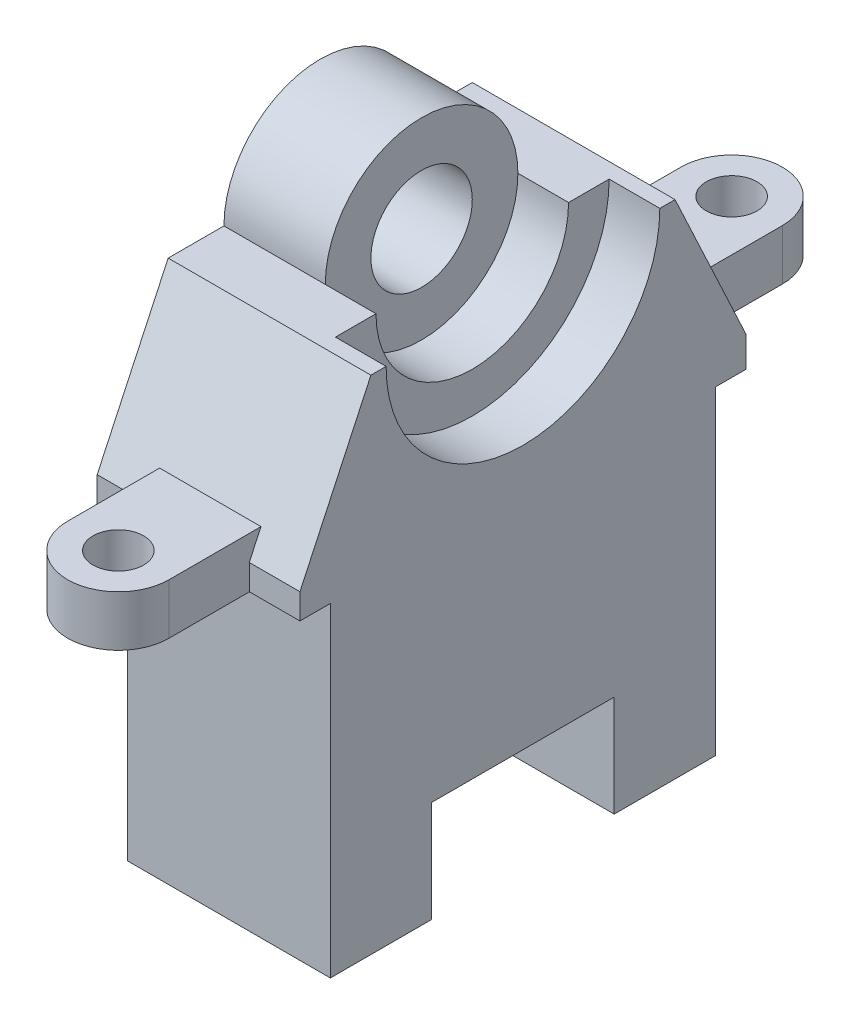
ISO-10303-21;
HEADER;
FILE_DESCRIPTION(('STEP AP214'),'2;1');
FILE_NAME('part.step','',(''),(''),'','','');
FILE_SCHEMA(('AUTOMOTIVE_DESIGN { 1 0 10303 214 1 1 1 1 }'));
ENDSEC;
DATA;
#1=APPLICATION_CONTEXT('core data for automotive mechanical design processes');
#2=APPLICATION_PROTOCOL_DEFINITION('international standard','automotive_design',2000,#1);
#3=PRODUCT_CONTEXT('',#1,'mechanical');
#4=PRODUCT('Part','Part','',(#3));
#5=PRODUCT_RELATED_PRODUCT_CATEGORY('part','',(#4));
#6=PRODUCT_DEFINITION_FORMATION('','',#4);
#7=PRODUCT_DEFINITION_CONTEXT('part definition',#1,'design');
#8=PRODUCT_DEFINITION('design','',#6,#7);
#9=PRODUCT_DEFINITION_SHAPE('','',#8);
#10=(LENGTH_UNIT() NAMED_UNIT(*) SI_UNIT(.MILLI.,.METRE.));
#11=(NAMED_UNIT(*) PLANE_ANGLE_UNIT() SI_UNIT($,.RADIAN.));
#12=(NAMED_UNIT(*) SI_UNIT($,.STERADIAN.) SOLID_ANGLE_UNIT());
#13=UNCERTAINTY_MEASURE_WITH_UNIT(LENGTH_MEASURE(1.E-05),#10,'distance_accuracy_value','');
#14=(GEOMETRIC_REPRESENTATION_CONTEXT(3) GLOBAL_UNCERTAINTY_ASSIGNED_CONTEXT((#13)) GLOBAL_UNIT_ASSIGNED_CONTEXT((#10,
#11,#12)) REPRESENTATION_CONTEXT('',''));
#15=CARTESIAN_POINT('',(0.,0.,0.));
#16=DIRECTION('',(0.,0.,1.));
#17=DIRECTION('',(1.,0.,0.));
#18=AXIS2_PLACEMENT_3D('',#15,#16,#17);
#19=CARTESIAN_POINT('',(40.,62.323723813514,30.7187028003413));
#20=DIRECTION('',(0.,-1.,0.));
#21=DIRECTION('',(0.,0.,-1.));
#22=AXIS2_PLACEMENT_3D('',#19,#20,#21);
#23=PLANE('',#22);
#24=DIRECTION('',(1.,0.,0.));
#25=VECTOR('',#24,1.);
#26=CARTESIAN_POINT('',(0.,62.323723813514,19.7187028003413));
#27=LINE('',#26,#25);
#28=CARTESIAN_POINT('',(0.,62.323723813514,19.7187028003413));
#29=VERTEX_POINT('',#28);
#30=CARTESIAN_POINT('',(20.,62.323723813514,19.7187028003413));
#31=VERTEX_POINT('',#30);
#32=EDGE_CURVE('E341',#29,#31,#27,.T.);
#33=ORIENTED_EDGE('',*,*,#32,.F.);
#34=DIRECTION('',(0.,0.,1.));
#35=VECTOR('',#34,1.);
#36=CARTESIAN_POINT('',(0.,62.323723813514,30.7187028003413));
#37=LINE('',#36,#35);
#38=CARTESIAN_POINT('',(0.,62.323723813514,30.7187028003413));
#39=VERTEX_POINT('',#38);
#40=EDGE_CURVE('E325',#29,#39,#37,.T.);
#41=ORIENTED_EDGE('',*,*,#40,.T.);
#42=DIRECTION('',(-1.,0.,0.));
#43=VECTOR('',#42,1.);
#44=CARTESIAN_POINT('',(40.,62.323723813514,30.7187028003413));
#45=LINE('',#44,#43);
#46=CARTESIAN_POINT('',(40.,62.323723813514,30.7187028003413));
#47=VERTEX_POINT('',#46);
#48=EDGE_CURVE('E587',#47,#39,#45,.T.);
#49=ORIENTED_EDGE('',*,*,#48,.F.);
#50=DIRECTION('',(0.,0.,1.));
#51=VECTOR('',#50,1.);
#52=CARTESIAN_POINT('',(40.,62.323723813514,30.7187028003413));
#53=LINE('',#52,#51);
#54=CARTESIAN_POINT('',(40.,62.323723813514,27.7187028003413));
#55=VERTEX_POINT('',#54);
#56=EDGE_CURVE('E650',#55,#47,#53,.T.);
#57=ORIENTED_EDGE('',*,*,#56,.F.);
#58=DIRECTION('',(-1.,0.,0.));
#59=VECTOR('',#58,1.);
#60=CARTESIAN_POINT('',(40.,62.323723813514,27.7187028003413));
#61=LINE('',#60,#59);
#62=CARTESIAN_POINT('',(30.,62.323723813514,27.7187028003413));
#63=VERTEX_POINT('',#62);
#64=EDGE_CURVE('E382',#63,#55,#61,.F.);
#65=ORIENTED_EDGE('',*,*,#64,.F.);
#66=DIRECTION('',(0.,0.,-1.));
#67=VECTOR('',#66,1.);
#68=CARTESIAN_POINT('',(30.,62.323723813514,27.7187028003413));
#69=LINE('',#68,#67);
#70=CARTESIAN_POINT('',(30.,62.323723813514,19.7187028003413));
#71=VERTEX_POINT('',#70);
#72=EDGE_CURVE('E360',#63,#71,#69,.T.);
#73=ORIENTED_EDGE('',*,*,#72,.T.);
#74=DIRECTION('',(1.,0.,0.));
#75=VECTOR('',#74,1.);
#76=CARTESIAN_POINT('',(20.,62.323723813514,19.7187028003413));
#77=LINE('',#76,#75);
#78=EDGE_CURVE('E343',#31,#71,#77,.T.);
#79=ORIENTED_EDGE('',*,*,#78,.F.);
#80=EDGE_LOOP('',(#33,#41,#49,#57,#65,#73,#79));
#81=FACE_BOUND('',#80,.T.);
#82=ADVANCED_FACE('F122',(#81),#23,.F.);
#83=CARTESIAN_POINT('',(0.,62.323723813514,-29.2812971996587));
#84=VERTEX_POINT('',#83);
#85=CARTESIAN_POINT('',(0.,62.323723813514,-18.2812971996587));
#86=VERTEX_POINT('',#85);
#87=EDGE_CURVE('E337',#84,#86,#37,.T.);
#88=ORIENTED_EDGE('',*,*,#87,.T.);
#89=DIRECTION('',(1.,0.,0.));
#90=VECTOR('',#89,1.);
#91=CARTESIAN_POINT('',(0.,62.323723813514,-18.2812971996587));
#92=LINE('',#91,#90);
#93=CARTESIAN_POINT('',(20.,62.323723813514,-18.2812971996587));
#94=VERTEX_POINT('',#93);
#95=EDGE_CURVE('E348',#86,#94,#92,.T.);
#96=ORIENTED_EDGE('',*,*,#95,.T.);
#97=DIRECTION('',(1.,0.,0.));
#98=VECTOR('',#97,1.);
#99=CARTESIAN_POINT('',(20.,62.323723813514,-18.2812971996587));
#100=LINE('',#99,#98);
#101=CARTESIAN_POINT('',(30.,62.323723813514,-18.2812971996587));
#102=VERTEX_POINT('',#101);
#103=EDGE_CURVE('E371',#94,#102,#100,.T.);
#104=ORIENTED_EDGE('',*,*,#103,.T.);
#105=DIRECTION('',(0.,0.,-1.));
#106=VECTOR('',#105,1.);
#107=CARTESIAN_POINT('',(30.,62.323723813514,-26.2812971996587));
#108=LINE('',#107,#106);
#109=CARTESIAN_POINT('',(30.,62.323723813514,-26.2812971996587));
#110=VERTEX_POINT('',#109);
#111=EDGE_CURVE('E365',#102,#110,#108,.T.);
#112=ORIENTED_EDGE('',*,*,#111,.T.);
#113=DIRECTION('',(-1.,0.,0.));
#114=VECTOR('',#113,1.);
#115=CARTESIAN_POINT('',(40.,62.323723813514,-26.2812971996587));
#116=LINE('',#115,#114);
#117=CARTESIAN_POINT('',(40.,62.323723813514,-26.2812971996587));
#118=VERTEX_POINT('',#117);
#119=EDGE_CURVE('E378',#118,#110,#116,.T.);
#120=ORIENTED_EDGE('',*,*,#119,.F.);
#121=CARTESIAN_POINT('',(40.,62.323723813514,-29.2812971996587));
#122=VERTEX_POINT('',#121);
#123=EDGE_CURVE('E656',#122,#118,#53,.T.);
#124=ORIENTED_EDGE('',*,*,#123,.F.);
#125=DIRECTION('',(-1.,0.,0.));
#126=VECTOR('',#125,1.);
#127=CARTESIAN_POINT('',(40.,62.323723813514,-29.2812971996587));
#128=LINE('',#127,#126);
#129=EDGE_CURVE('E589',#122,#84,#128,.T.);
#130=ORIENTED_EDGE('',*,*,#129,.T.);
#131=EDGE_LOOP('',(#88,#96,#104,#112,#120,#124,#130));
#132=FACE_BOUND('',#131,.T.);
#133=ADVANCED_FACE('F501',(#132),#23,.F.);
#134=CARTESIAN_POINT('',(40.,-36.676276186486,38.7187028003413));
#135=DIRECTION('',(0.,1.,0.));
#136=DIRECTION('',(0.,0.,1.));
#137=AXIS2_PLACEMENT_3D('',#134,#135,#136);
#138=PLANE('',#137);
#139=DIRECTION('',(0.,0.,-1.));
#140=VECTOR('',#139,1.);
#141=CARTESIAN_POINT('',(0.,-36.676276186486,38.7187028003413));
#142=LINE('',#141,#140);
#143=CARTESIAN_POINT('',(0.,-36.676276186486,38.7187028003413));
#144=VERTEX_POINT('',#143);
#145=CARTESIAN_POINT('',(0.,-36.676276186486,18.7187028003413));
#146=VERTEX_POINT('',#145);
#147=EDGE_CURVE('E547',#144,#146,#142,.T.);
#148=ORIENTED_EDGE('',*,*,#147,.T.);
#149=DIRECTION('',(1.,0.,0.));
#150=VECTOR('',#149,1.);
#151=CARTESIAN_POINT('',(-3.,-36.676276186486,18.7187028003413));
#152=LINE('',#151,#150);
#153=CARTESIAN_POINT('',(40.,-36.676276186486,18.7187028003413));
#154=VERTEX_POINT('',#153);
#155=EDGE_CURVE('E392',#146,#154,#152,.T.);
#156=ORIENTED_EDGE('',*,*,#155,.T.);
#157=DIRECTION('',(0.,0.,-1.));
#158=VECTOR('',#157,1.);
#159=CARTESIAN_POINT('',(40.,-36.676276186486,38.7187028003413));
#160=LINE('',#159,#158);
#161=CARTESIAN_POINT('',(40.,-36.676276186486,38.7187028003413));
#162=VERTEX_POINT('',#161);
#163=EDGE_CURVE('E682',#162,#154,#160,.T.);
#164=ORIENTED_EDGE('',*,*,#163,.F.);
#165=DIRECTION('',(-1.,0.,0.));
#166=VECTOR('',#165,1.);
#167=CARTESIAN_POINT('',(40.,-36.676276186486,38.7187028003413));
#168=LINE('',#167,#166);
#169=EDGE_CURVE('E550',#162,#144,#168,.T.);
#170=ORIENTED_EDGE('',*,*,#169,.T.);
#171=EDGE_LOOP('',(#148,#156,#164,#170));
#172=FACE_BOUND('',#171,.T.);
#173=ADVANCED_FACE('F506',(#172),#138,.F.);
#174=CARTESIAN_POINT('',(30.,37.2893818441082,39.546748703208));
#175=DIRECTION('',(0.,1.,0.));
#176=DIRECTION('',(0.,0.,1.));
#177=AXIS2_PLACEMENT_3D('',#174,#175,#176);
#178=PLANE('',#177);
#179=CARTESIAN_POINT('',(20.,37.2893818441082,60.546748703208));
#180=DIRECTION('',(0.,1.,0.));
#181=DIRECTION('',(0.,0.,1.));
#182=AXIS2_PLACEMENT_3D('',#179,#180,#181);
#183=CIRCLE('',#182,10.);
#184=CARTESIAN_POINT('',(30.,37.2893818441082,60.546748703208));
#185=VERTEX_POINT('',#184);
#186=CARTESIAN_POINT('',(10.,37.2893818441082,60.546748703208));
#187=VERTEX_POINT('',#186);
#188=EDGE_CURVE('E407',#185,#187,#183,.F.);
#189=ORIENTED_EDGE('',*,*,#188,.F.);
#190=DIRECTION('',(0.,0.,-1.));
#191=VECTOR('',#190,1.);
#192=CARTESIAN_POINT('',(30.,37.2893818441082,39.546748703208));
#193=LINE('',#192,#191);
#194=CARTESIAN_POINT('',(30.,37.2893818441082,42.4013957193974));
#195=VERTEX_POINT('',#194);
#196=EDGE_CURVE('E432',#185,#195,#193,.T.);
#197=ORIENTED_EDGE('',*,*,#196,.T.);
#198=DIRECTION('',(1.,0.,0.));
#199=VECTOR('',#198,1.);
#200=CARTESIAN_POINT('',(40.,37.2893818441082,42.4013957193974));
#201=LINE('',#200,#199);
#202=CARTESIAN_POINT('',(10.,37.2893818441082,42.4013957193974));
#203=VERTEX_POINT('',#202);
#204=EDGE_CURVE('E611',#203,#195,#201,.T.);
#205=ORIENTED_EDGE('',*,*,#204,.F.);
#206=DIRECTION('',(0.,0.,-1.));
#207=VECTOR('',#206,1.);
#208=CARTESIAN_POINT('',(10.,37.2893818441082,39.546748703208));
#209=LINE('',#208,#207);
#210=EDGE_CURVE('E440',#187,#203,#209,.T.);
#211=ORIENTED_EDGE('',*,*,#210,.F.);
#212=EDGE_LOOP('',(#189,#197,#205,#211));
#213=FACE_BOUND('',#212,.T.);
#214=CARTESIAN_POINT('',(20.,37.2893818441082,60.546748703208));
#215=DIRECTION('',(0.,1.,0.));
#216=DIRECTION('',(0.,0.,1.));
#217=AXIS2_PLACEMENT_3D('',#214,#215,#216);
#218=CIRCLE('',#217,5.);
#219=CARTESIAN_POINT('',(20.,37.2893818441082,65.546748703208));
#220=VERTEX_POINT('',#219);
#221=EDGE_CURVE('E403',#220,#220,#218,.F.);
#222=ORIENTED_EDGE('',*,*,#221,.T.);
#223=EDGE_LOOP('',(#222));
#224=FACE_BOUND('',#223,.T.);
#225=ADVANCED_FACE('F537',(#213,#224),#178,.T.);
#226=CARTESIAN_POINT('',(10.,27.2893818441082,39.546748703208));
#227=DIRECTION('',(0.,-1.,0.));
#228=DIRECTION('',(0.,0.,-1.));
#229=AXIS2_PLACEMENT_3D('',#226,#227,#228);
#230=PLANE('',#229);
#231=DIRECTION('',(0.,0.,-1.));
#232=VECTOR('',#231,1.);
#233=CARTESIAN_POINT('',(30.,27.2893818441082,39.546748703208));
#234=LINE('',#233,#232);
#235=CARTESIAN_POINT('',(30.,27.2893818441082,60.546748703208));
#236=VERTEX_POINT('',#235);
#237=CARTESIAN_POINT('',(30.,27.2893818441082,38.7187028003413));
#238=VERTEX_POINT('',#237);
#239=EDGE_CURVE('E445',#236,#238,#234,.T.);
#240=ORIENTED_EDGE('',*,*,#239,.F.);
#241=CARTESIAN_POINT('',(20.,27.2893818441082,60.546748703208));
#242=DIRECTION('',(0.,-1.,0.));
#243=DIRECTION('',(0.,0.,-1.));
#244=AXIS2_PLACEMENT_3D('',#241,#242,#243);
#245=CIRCLE('',#244,10.);
#246=CARTESIAN_POINT('',(10.,27.2893818441082,60.546748703208));
#247=VERTEX_POINT('',#246);
#248=EDGE_CURVE('E474',#247,#236,#245,.F.);
#249=ORIENTED_EDGE('',*,*,#248,.F.);
#250=DIRECTION('',(0.,0.,-1.));
#251=VECTOR('',#250,1.);
#252=CARTESIAN_POINT('',(10.,27.2893818441082,39.546748703208));
#253=LINE('',#252,#251);
#254=CARTESIAN_POINT('',(10.,27.2893818441082,38.7187028003413));
#255=VERTEX_POINT('',#254);
#256=EDGE_CURVE('E446',#247,#255,#253,.T.);
#257=ORIENTED_EDGE('',*,*,#256,.T.);
#258=DIRECTION('',(-1.,0.,0.));
#259=VECTOR('',#258,1.);
#260=CARTESIAN_POINT('',(40.,27.2893818441082,38.7187028003413));
#261=LINE('',#260,#259);
#262=EDGE_CURVE('E674',#238,#255,#261,.T.);
#263=ORIENTED_EDGE('',*,*,#262,.F.);
#264=EDGE_LOOP('',(#240,#249,#257,#263));
#265=FACE_BOUND('',#264,.T.);
#266=CARTESIAN_POINT('',(20.,27.2893818441082,60.546748703208));
#267=DIRECTION('',(0.,-1.,0.));
#268=DIRECTION('',(0.,0.,-1.));
#269=AXIS2_PLACEMENT_3D('',#266,#267,#268);
#270=CIRCLE('',#269,5.);
#271=CARTESIAN_POINT('',(20.,27.2893818441082,55.546748703208));
#272=VERTEX_POINT('',#271);
#273=EDGE_CURVE('E402',#272,#272,#270,.F.);
#274=ORIENTED_EDGE('',*,*,#273,.T.);
#275=EDGE_LOOP('',(#274));
#276=FACE_BOUND('',#275,.T.);
#277=ADVANCED_FACE('F481',(#265,#276),#230,.T.);
#278=CARTESIAN_POINT('',(10.,37.2893818441082,39.546748703208));
#279=DIRECTION('',(-1.,0.,0.));
#280=DIRECTION('',(0.,0.,1.));
#281=AXIS2_PLACEMENT_3D('',#278,#279,#280);
#282=PLANE('',#281);
#283=ORIENTED_EDGE('',*,*,#256,.F.);
#284=DIRECTION('',(0.,-1.,0.));
#285=VECTOR('',#284,1.);
#286=CARTESIAN_POINT('',(10.,84.,60.546748703208));
#287=LINE('',#286,#285);
#288=EDGE_CURVE('E145',#187,#247,#287,.T.);
#289=ORIENTED_EDGE('',*,*,#288,.F.);
#290=ORIENTED_EDGE('',*,*,#210,.T.);
#291=DIRECTION('',(0.,0.906183139995266,-0.422885465331124));
#292=VECTOR('',#291,1.);
#293=CARTESIAN_POINT('',(10.,32.323723813514,44.7187028003413));
#294=LINE('',#293,#292);
#295=CARTESIAN_POINT('',(10.,32.323723813514,44.7187028003413));
#296=VERTEX_POINT('',#295);
#297=EDGE_CURVE('E696',#296,#203,#294,.T.);
#298=ORIENTED_EDGE('',*,*,#297,.F.);
#299=DIRECTION('',(0.,1.,0.));
#300=VECTOR('',#299,1.);
#301=CARTESIAN_POINT('',(10.,27.323723813514,44.7187028003413));
#302=LINE('',#301,#300);
#303=CARTESIAN_POINT('',(10.,27.323723813514,44.7187028003413));
#304=VERTEX_POINT('',#303);
#305=EDGE_CURVE('E462',#304,#296,#302,.T.);
#306=ORIENTED_EDGE('',*,*,#305,.F.);
#307=DIRECTION('',(0.,0.,1.));
#308=VECTOR('',#307,1.);
#309=CARTESIAN_POINT('',(10.,27.323723813514,38.7187028003413));
#310=LINE('',#309,#308);
#311=CARTESIAN_POINT('',(10.,27.323723813514,38.7187028003413));
#312=VERTEX_POINT('',#311);
#313=EDGE_CURVE('E609',#312,#304,#310,.T.);
#314=ORIENTED_EDGE('',*,*,#313,.F.);
#315=DIRECTION('',(0.,1.,0.));
#316=VECTOR('',#315,1.);
#317=CARTESIAN_POINT('',(10.,-36.676276186486,38.7187028003413));
#318=LINE('',#317,#316);
#319=EDGE_CURVE('E670',#255,#312,#318,.T.);
#320=ORIENTED_EDGE('',*,*,#319,.F.);
#321=EDGE_LOOP('',(#283,#289,#290,#298,#306,#314,#320));
#322=FACE_BOUND('',#321,.T.);
#323=ADVANCED_FACE('F768',(#322),#282,.T.);
#324=CARTESIAN_POINT('',(20.,27.2893818441082,-60.453251296792));
#325=DIRECTION('',(0.,-1.,0.));
#326=DIRECTION('',(0.,0.,-1.));
#327=AXIS2_PLACEMENT_3D('',#324,#325,#326);
#328=CIRCLE('',#327,5.);
#329=CARTESIAN_POINT('',(20.,27.2893818441082,-65.453251296792));
#330=VERTEX_POINT('',#329);
#331=EDGE_CURVE('E415',#330,#330,#328,.T.);
#332=ORIENTED_EDGE('',*,*,#331,.F.);
#333=EDGE_LOOP('',(#332));
#334=FACE_BOUND('',#333,.T.);
#335=CARTESIAN_POINT('',(20.,27.2893818441082,-60.453251296792));
#336=DIRECTION('',(0.,-1.,0.));
#337=DIRECTION('',(0.,0.,-1.));
#338=AXIS2_PLACEMENT_3D('',#335,#336,#337);
#339=CIRCLE('',#338,10.);
#340=CARTESIAN_POINT('',(10.,27.2893818441082,-60.453251296792));
#341=VERTEX_POINT('',#340);
#342=CARTESIAN_POINT('',(30.,27.2893818441082,-60.453251296792));
#343=VERTEX_POINT('',#342);
#344=EDGE_CURVE('E423',#341,#343,#339,.T.);
#345=ORIENTED_EDGE('',*,*,#344,.T.);
#346=CARTESIAN_POINT('',(30.,27.2893818441082,-43.2812971996586));
#347=VERTEX_POINT('',#346);
#348=EDGE_CURVE('E442',#347,#343,#234,.T.);
#349=ORIENTED_EDGE('',*,*,#348,.F.);
#350=DIRECTION('',(1.,0.,0.));
#351=VECTOR('',#350,1.);
#352=CARTESIAN_POINT('',(40.,27.2893818441082,-43.2812971996586));
#353=LINE('',#352,#351);
#354=CARTESIAN_POINT('',(10.,27.2893818441082,-43.2812971996586));
#355=VERTEX_POINT('',#354);
#356=EDGE_CURVE('E472',#355,#347,#353,.T.);
#357=ORIENTED_EDGE('',*,*,#356,.F.);
#358=EDGE_CURVE('E463',#355,#341,#253,.T.);
#359=ORIENTED_EDGE('',*,*,#358,.T.);
#360=EDGE_LOOP('',(#345,#349,#357,#359));
#361=FACE_BOUND('',#360,.T.);
#362=ADVANCED_FACE('F624',(#334,#361),#230,.T.);
#363=CARTESIAN_POINT('',(20.,37.2893818441082,-60.453251296792));
#364=DIRECTION('',(0.,1.,0.));
#365=DIRECTION('',(0.,0.,1.));
#366=AXIS2_PLACEMENT_3D('',#363,#364,#365);
#367=CIRCLE('',#366,5.);
#368=CARTESIAN_POINT('',(20.,37.2893818441082,-55.453251296792));
#369=VERTEX_POINT('',#368);
#370=EDGE_CURVE('E409',#369,#369,#367,.T.);
#371=ORIENTED_EDGE('',*,*,#370,.F.);
#372=EDGE_LOOP('',(#371));
#373=FACE_BOUND('',#372,.T.);
#374=CARTESIAN_POINT('',(30.,37.2893818441082,-40.9639901187147));
#375=VERTEX_POINT('',#374);
#376=CARTESIAN_POINT('',(30.,37.2893818441082,-60.453251296792));
#377=VERTEX_POINT('',#376);
#378=EDGE_CURVE('E436',#375,#377,#193,.T.);
#379=ORIENTED_EDGE('',*,*,#378,.T.);
#380=CARTESIAN_POINT('',(20.,37.2893818441082,-60.453251296792));
#381=DIRECTION('',(0.,1.,0.));
#382=DIRECTION('',(0.,0.,1.));
#383=AXIS2_PLACEMENT_3D('',#380,#381,#382);
#384=CIRCLE('',#383,10.);
#385=CARTESIAN_POINT('',(10.,37.2893818441082,-60.453251296792));
#386=VERTEX_POINT('',#385);
#387=EDGE_CURVE('E418',#377,#386,#384,.T.);
#388=ORIENTED_EDGE('',*,*,#387,.T.);
#389=CARTESIAN_POINT('',(10.,37.2893818441082,-40.9639901187147));
#390=VERTEX_POINT('',#389);
#391=EDGE_CURVE('E425',#390,#386,#209,.T.);
#392=ORIENTED_EDGE('',*,*,#391,.F.);
#393=DIRECTION('',(-1.,0.,0.));
#394=VECTOR('',#393,1.);
#395=CARTESIAN_POINT('',(40.,37.2893818441082,-40.9639901187147));
#396=LINE('',#395,#394);
#397=EDGE_CURVE('E637',#375,#390,#396,.T.);
#398=ORIENTED_EDGE('',*,*,#397,.F.);
#399=EDGE_LOOP('',(#379,#388,#392,#398));
#400=FACE_BOUND('',#399,.T.);
#401=ADVANCED_FACE('F544',(#373,#400),#178,.T.);
#402=CARTESIAN_POINT('',(30.,37.2893818441082,39.546748703208));
#403=DIRECTION('',(1.,0.,0.));
#404=DIRECTION('',(0.,0.,-1.));
#405=AXIS2_PLACEMENT_3D('',#402,#403,#404);
#406=PLANE('',#405);
#407=ORIENTED_EDGE('',*,*,#348,.T.);
#408=DIRECTION('',(0.,1.,0.));
#409=VECTOR('',#408,1.);
#410=CARTESIAN_POINT('',(30.,7.28938184410818,-60.453251296792));
#411=LINE('',#410,#409);
#412=EDGE_CURVE('E412',#343,#377,#411,.T.);
#413=ORIENTED_EDGE('',*,*,#412,.T.);
#414=ORIENTED_EDGE('',*,*,#378,.F.);
#415=DIRECTION('',(0.,0.906183139995266,0.422885465331124));
#416=VECTOR('',#415,1.);
#417=CARTESIAN_POINT('',(30.,62.323723813514,-29.2812971996587));
#418=LINE('',#417,#416);
#419=CARTESIAN_POINT('',(30.,32.323723813514,-43.2812971996587));
#420=VERTEX_POINT('',#419);
#421=EDGE_CURVE('E456',#420,#375,#418,.T.);
#422=ORIENTED_EDGE('',*,*,#421,.F.);
#423=DIRECTION('',(0.,1.,0.));
#424=VECTOR('',#423,1.);
#425=CARTESIAN_POINT('',(30.,26.323723813514,-43.2812971996586));
#426=LINE('',#425,#424);
#427=EDGE_CURVE('E459',#347,#420,#426,.T.);
#428=ORIENTED_EDGE('',*,*,#427,.F.);
#429=EDGE_LOOP('',(#407,#413,#414,#422,#428));
#430=FACE_BOUND('',#429,.T.);
#431=ADVANCED_FACE('F639',(#430),#406,.T.);
#432=CARTESIAN_POINT('',(40.,27.323723813514,44.7187028003413));
#433=DIRECTION('',(0.,0.,-1.));
#434=DIRECTION('',(-1.,0.,0.));
#435=AXIS2_PLACEMENT_3D('',#432,#433,#434);
#436=PLANE('',#435);
#437=DIRECTION('',(-1.,0.,0.));
#438=VECTOR('',#437,1.);
#439=CARTESIAN_POINT('',(40.,27.323723813514,44.7187028003413));
#440=LINE('',#439,#438);
#441=CARTESIAN_POINT('',(0.,27.323723813514,44.7187028003413));
#442=VERTEX_POINT('',#441);
#443=EDGE_CURVE('E578',#304,#442,#440,.T.);
#444=ORIENTED_EDGE('',*,*,#443,.F.);
#445=ORIENTED_EDGE('',*,*,#305,.T.);
#446=DIRECTION('',(-1.,0.,0.));
#447=VECTOR('',#446,1.);
#448=CARTESIAN_POINT('',(40.,32.323723813514,44.7187028003413));
#449=LINE('',#448,#447);
#450=CARTESIAN_POINT('',(0.,32.323723813514,44.7187028003413));
#451=VERTEX_POINT('',#450);
#452=EDGE_CURVE('E583',#296,#451,#449,.T.);
#453=ORIENTED_EDGE('',*,*,#452,.T.);
#454=DIRECTION('',(0.,-1.,0.));
#455=VECTOR('',#454,1.);
#456=CARTESIAN_POINT('',(0.,27.323723813514,44.7187028003413));
#457=LINE('',#456,#455);
#458=EDGE_CURVE('E568',#451,#442,#457,.T.);
#459=ORIENTED_EDGE('',*,*,#458,.T.);
#460=EDGE_LOOP('',(#444,#445,#453,#459));
#461=FACE_BOUND('',#460,.T.);
#462=ADVANCED_FACE('F702',(#461),#436,.F.);
#463=CARTESIAN_POINT('',(40.,27.323723813514,38.7187028003413));
#464=DIRECTION('',(0.,1.,0.));
#465=DIRECTION('',(0.,0.,1.));
#466=AXIS2_PLACEMENT_3D('',#463,#464,#465);
#467=PLANE('',#466);
#468=DIRECTION('',(-1.,0.,0.));
#469=VECTOR('',#468,1.);
#470=CARTESIAN_POINT('',(40.,27.323723813514,38.7187028003413));
#471=LINE('',#470,#469);
#472=CARTESIAN_POINT('',(0.,27.323723813514,38.7187028003413));
#473=VERTEX_POINT('',#472);
#474=EDGE_CURVE('E579',#312,#473,#471,.T.);
#475=ORIENTED_EDGE('',*,*,#474,.F.);
#476=ORIENTED_EDGE('',*,*,#313,.T.);
#477=ORIENTED_EDGE('',*,*,#443,.T.);
#478=DIRECTION('',(0.,0.,-1.));
#479=VECTOR('',#478,1.);
#480=CARTESIAN_POINT('',(0.,27.323723813514,38.7187028003413));
#481=LINE('',#480,#479);
#482=EDGE_CURVE('E571',#442,#473,#481,.T.);
#483=ORIENTED_EDGE('',*,*,#482,.T.);
#484=EDGE_LOOP('',(#475,#476,#477,#483));
#485=FACE_BOUND('',#484,.T.);
#486=ADVANCED_FACE('F533',(#485),#467,.F.);
#487=CARTESIAN_POINT('',(40.,-36.676276186486,38.7187028003413));
#488=DIRECTION('',(0.,0.,-1.));
#489=DIRECTION('',(-1.,0.,0.));
#490=AXIS2_PLACEMENT_3D('',#487,#488,#489);
#491=PLANE('',#490);
#492=ORIENTED_EDGE('',*,*,#262,.T.);
#493=ORIENTED_EDGE('',*,*,#319,.T.);
#494=ORIENTED_EDGE('',*,*,#474,.T.);
#495=DIRECTION('',(0.,-1.,0.));
#496=VECTOR('',#495,1.);
#497=CARTESIAN_POINT('',(0.,-36.676276186486,38.7187028003413));
#498=LINE('',#497,#496);
#499=EDGE_CURVE('E558',#473,#144,#498,.T.);
#500=ORIENTED_EDGE('',*,*,#499,.T.);
#501=ORIENTED_EDGE('',*,*,#169,.F.);
#502=DIRECTION('',(0.,-1.,0.));
#503=VECTOR('',#502,1.);
#504=CARTESIAN_POINT('',(40.,-36.676276186486,38.7187028003413));
#505=LINE('',#504,#503);
#506=CARTESIAN_POINT('',(40.,27.323723813514,38.7187028003413));
#507=VERTEX_POINT('',#506);
#508=EDGE_CURVE('E574',#507,#162,#505,.T.);
#509=ORIENTED_EDGE('',*,*,#508,.F.);
#510=CARTESIAN_POINT('',(30.,27.323723813514,38.7187028003413));
#511=VERTEX_POINT('',#510);
#512=EDGE_CURVE('E575',#507,#511,#471,.T.);
#513=ORIENTED_EDGE('',*,*,#512,.T.);
#514=DIRECTION('',(0.,-1.,0.));
#515=VECTOR('',#514,1.);
#516=CARTESIAN_POINT('',(30.,-36.676276186486,38.7187028003413));
#517=LINE('',#516,#515);
#518=EDGE_CURVE('E453',#511,#238,#517,.T.);
#519=ORIENTED_EDGE('',*,*,#518,.T.);
#520=EDGE_LOOP('',(#492,#493,#494,#500,#501,#509,#513,#519));
#521=FACE_BOUND('',#520,.T.);
#522=ADVANCED_FACE('F124',(#521),#491,.F.);
#523=CARTESIAN_POINT('',(40.,-36.676276186486,-17.2812971996587));
#524=VERTEX_POINT('',#523);
#525=CARTESIAN_POINT('',(40.,-36.676276186486,-37.2812971996587));
#526=VERTEX_POINT('',#525);
#527=EDGE_CURVE('E681',#524,#526,#160,.T.);
#528=ORIENTED_EDGE('',*,*,#527,.F.);
#529=DIRECTION('',(1.,0.,0.));
#530=VECTOR('',#529,1.);
#531=CARTESIAN_POINT('',(-3.,-36.676276186486,-17.2812971996587));
#532=LINE('',#531,#530);
#533=CARTESIAN_POINT('',(0.,-36.676276186486,-17.2812971996587));
#534=VERTEX_POINT('',#533);
#535=EDGE_CURVE('E391',#534,#524,#532,.T.);
#536=ORIENTED_EDGE('',*,*,#535,.F.);
#537=CARTESIAN_POINT('',(0.,-36.676276186486,-37.2812971996587));
#538=VERTEX_POINT('',#537);
#539=EDGE_CURVE('E554',#534,#538,#142,.T.);
#540=ORIENTED_EDGE('',*,*,#539,.T.);
#541=DIRECTION('',(-1.,0.,0.));
#542=VECTOR('',#541,1.);
#543=CARTESIAN_POINT('',(40.,-36.676276186486,-37.2812971996587));
#544=LINE('',#543,#542);
#545=EDGE_CURVE('E602',#526,#538,#544,.T.);
#546=ORIENTED_EDGE('',*,*,#545,.F.);
#547=EDGE_LOOP('',(#528,#536,#540,#546));
#548=FACE_BOUND('',#547,.T.);
#549=ADVANCED_FACE('F526',(#548),#138,.F.);
#550=CARTESIAN_POINT('',(40.,-36.676276186486,-37.2812971996587));
#551=DIRECTION('',(0.,0.,1.));
#552=DIRECTION('',(1.,0.,0.));
#553=AXIS2_PLACEMENT_3D('',#550,#551,#552);
#554=PLANE('',#553);
#555=DIRECTION('',(0.,1.,0.));
#556=VECTOR('',#555,1.);
#557=CARTESIAN_POINT('',(0.,-36.676276186486,-37.2812971996587));
#558=LINE('',#557,#556);
#559=CARTESIAN_POINT('',(0.,26.323723813514,-37.2812971996587));
#560=VERTEX_POINT('',#559);
#561=EDGE_CURVE('E553',#538,#560,#558,.T.);
#562=ORIENTED_EDGE('',*,*,#561,.T.);
#563=DIRECTION('',(-1.,0.,0.));
#564=VECTOR('',#563,1.);
#565=CARTESIAN_POINT('',(40.,26.323723813514,-37.2812971996587));
#566=LINE('',#565,#564);
#567=CARTESIAN_POINT('',(40.,26.323723813514,-37.2812971996587));
#568=VERTEX_POINT('',#567);
#569=EDGE_CURVE('E599',#568,#560,#566,.T.);
#570=ORIENTED_EDGE('',*,*,#569,.F.);
#571=DIRECTION('',(0.,1.,0.));
#572=VECTOR('',#571,1.);
#573=CARTESIAN_POINT('',(40.,-36.676276186486,-37.2812971996587));
#574=LINE('',#573,#572);
#575=EDGE_CURVE('E652',#526,#568,#574,.T.);
#576=ORIENTED_EDGE('',*,*,#575,.F.);
#577=ORIENTED_EDGE('',*,*,#545,.T.);
#578=EDGE_LOOP('',(#562,#570,#576,#577));
#579=FACE_BOUND('',#578,.T.);
#580=ADVANCED_FACE('F523',(#579),#554,.F.);
#581=CARTESIAN_POINT('',(40.,26.323723813514,-37.2812971996587));
#582=DIRECTION('',(0.,1.,0.));
#583=DIRECTION('',(0.,0.,1.));
#584=AXIS2_PLACEMENT_3D('',#581,#582,#583);
#585=PLANE('',#584);
#586=DIRECTION('',(0.,0.,-1.));
#587=VECTOR('',#586,1.);
#588=CARTESIAN_POINT('',(0.,26.323723813514,-37.2812971996587));
#589=LINE('',#588,#587);
#590=CARTESIAN_POINT('',(0.,26.323723813514,-43.2812971996586));
#591=VERTEX_POINT('',#590);
#592=EDGE_CURVE('E556',#560,#591,#589,.T.);
#593=ORIENTED_EDGE('',*,*,#592,.T.);
#594=DIRECTION('',(-1.,0.,0.));
#595=VECTOR('',#594,1.);
#596=CARTESIAN_POINT('',(40.,26.323723813514,-43.2812971996586));
#597=LINE('',#596,#595);
#598=CARTESIAN_POINT('',(40.,26.323723813514,-43.2812971996586));
#599=VERTEX_POINT('',#598);
#600=EDGE_CURVE('E596',#599,#591,#597,.T.);
#601=ORIENTED_EDGE('',*,*,#600,.F.);
#602=DIRECTION('',(0.,0.,-1.));
#603=VECTOR('',#602,1.);
#604=CARTESIAN_POINT('',(40.,26.323723813514,-37.2812971996587));
#605=LINE('',#604,#603);
#606=EDGE_CURVE('E648',#568,#599,#605,.T.);
#607=ORIENTED_EDGE('',*,*,#606,.F.);
#608=ORIENTED_EDGE('',*,*,#569,.T.);
#609=EDGE_LOOP('',(#593,#601,#607,#608));
#610=FACE_BOUND('',#609,.T.);
#611=ADVANCED_FACE('F519',(#610),#585,.F.);
#612=CARTESIAN_POINT('',(40.,26.323723813514,-43.2812971996586));
#613=DIRECTION('',(0.,0.,1.));
#614=DIRECTION('',(0.,-1.,0.));
#615=AXIS2_PLACEMENT_3D('',#612,#613,#614);
#616=PLANE('',#615);
#617=DIRECTION('',(-1.,0.,0.));
#618=VECTOR('',#617,1.);
#619=CARTESIAN_POINT('',(40.,32.323723813514,-43.2812971996587));
#620=LINE('',#619,#618);
#621=CARTESIAN_POINT('',(10.,32.323723813514,-43.2812971996587));
#622=VERTEX_POINT('',#621);
#623=CARTESIAN_POINT('',(0.,32.323723813514,-43.2812971996587));
#624=VERTEX_POINT('',#623);
#625=EDGE_CURVE('E592',#622,#624,#620,.T.);
#626=ORIENTED_EDGE('',*,*,#625,.F.);
#627=DIRECTION('',(0.,-1.,0.));
#628=VECTOR('',#627,1.);
#629=CARTESIAN_POINT('',(10.,26.323723813514,-43.2812971996586));
#630=LINE('',#629,#628);
#631=EDGE_CURVE('E620',#622,#355,#630,.T.);
#632=ORIENTED_EDGE('',*,*,#631,.T.);
#633=ORIENTED_EDGE('',*,*,#356,.T.);
#634=ORIENTED_EDGE('',*,*,#427,.T.);
#635=CARTESIAN_POINT('',(40.,32.323723813514,-43.2812971996587));
#636=VERTEX_POINT('',#635);
#637=EDGE_CURVE('E593',#636,#420,#620,.T.);
#638=ORIENTED_EDGE('',*,*,#637,.F.);
#639=DIRECTION('',(0.,1.,0.));
#640=VECTOR('',#639,1.);
#641=CARTESIAN_POINT('',(40.,26.323723813514,-43.2812971996586));
#642=LINE('',#641,#640);
#643=EDGE_CURVE('E644',#599,#636,#642,.T.);
#644=ORIENTED_EDGE('',*,*,#643,.F.);
#645=ORIENTED_EDGE('',*,*,#600,.T.);
#646=DIRECTION('',(0.,1.,0.));
#647=VECTOR('',#646,1.);
#648=CARTESIAN_POINT('',(0.,26.323723813514,-43.2812971996586));
#649=LINE('',#648,#647);
#650=EDGE_CURVE('E563',#591,#624,#649,.T.);
#651=ORIENTED_EDGE('',*,*,#650,.T.);
#652=EDGE_LOOP('',(#626,#632,#633,#634,#638,#644,#645,#651));
#653=FACE_BOUND('',#652,.T.);
#654=ADVANCED_FACE('F515',(#653),#616,.F.);
#655=CARTESIAN_POINT('',(40.,62.323723813514,-29.2812971996587));
#656=DIRECTION('',(0.,-0.422885465331124,0.906183139995265));
#657=DIRECTION('',(0.,-0.906183139995266,-0.422885465331124));
#658=AXIS2_PLACEMENT_3D('',#655,#656,#657);
#659=PLANE('',#658);
#660=ORIENTED_EDGE('',*,*,#397,.T.);
#661=DIRECTION('',(0.,-0.906183139995266,-0.422885465331124));
#662=VECTOR('',#661,1.);
#663=CARTESIAN_POINT('',(10.,62.323723813514,-29.2812971996587));
#664=LINE('',#663,#662);
#665=EDGE_CURVE('E694',#390,#622,#664,.T.);
#666=ORIENTED_EDGE('',*,*,#665,.T.);
#667=ORIENTED_EDGE('',*,*,#625,.T.);
#668=DIRECTION('',(0.,0.906183139995265,0.422885465331124));
#669=VECTOR('',#668,1.);
#670=CARTESIAN_POINT('',(0.,62.323723813514,-29.2812971996587));
#671=LINE('',#670,#669);
#672=EDGE_CURVE('E338',#624,#84,#671,.T.);
#673=ORIENTED_EDGE('',*,*,#672,.T.);
#674=ORIENTED_EDGE('',*,*,#129,.F.);
#675=DIRECTION('',(0.,0.906183139995265,0.422885465331124));
#676=VECTOR('',#675,1.);
#677=CARTESIAN_POINT('',(40.,62.323723813514,-29.2812971996587));
#678=LINE('',#677,#676);
#679=EDGE_CURVE('E642',#636,#122,#678,.T.);
#680=ORIENTED_EDGE('',*,*,#679,.F.);
#681=ORIENTED_EDGE('',*,*,#637,.T.);
#682=ORIENTED_EDGE('',*,*,#421,.T.);
#683=EDGE_LOOP('',(#660,#666,#667,#673,#674,#680,#681,#682));
#684=FACE_BOUND('',#683,.T.);
#685=ADVANCED_FACE('F512',(#684),#659,.F.);
#686=CARTESIAN_POINT('',(40.,32.323723813514,44.7187028003413));
#687=DIRECTION('',(0.,-0.422885465331124,-0.906183139995265));
#688=DIRECTION('',(0.,0.906183139995266,-0.422885465331124));
#689=AXIS2_PLACEMENT_3D('',#686,#687,#688);
#690=PLANE('',#689);
#691=ORIENTED_EDGE('',*,*,#452,.F.);
#692=ORIENTED_EDGE('',*,*,#297,.T.);
#693=ORIENTED_EDGE('',*,*,#204,.T.);
#694=DIRECTION('',(0.,-0.906183139995266,0.422885465331124));
#695=VECTOR('',#694,1.);
#696=CARTESIAN_POINT('',(30.,32.323723813514,44.7187028003413));
#697=LINE('',#696,#695);
#698=CARTESIAN_POINT('',(30.,32.323723813514,44.7187028003413));
#699=VERTEX_POINT('',#698);
#700=EDGE_CURVE('E450',#195,#699,#697,.T.);
#701=ORIENTED_EDGE('',*,*,#700,.T.);
#702=CARTESIAN_POINT('',(40.,32.323723813514,44.7187028003413));
#703=VERTEX_POINT('',#702);
#704=EDGE_CURVE('E584',#703,#699,#449,.T.);
#705=ORIENTED_EDGE('',*,*,#704,.F.);
#706=DIRECTION('',(0.,-0.906183139995265,0.422885465331124));
#707=VECTOR('',#706,1.);
#708=CARTESIAN_POINT('',(40.,32.323723813514,44.7187028003413));
#709=LINE('',#708,#707);
#710=EDGE_CURVE('E659',#47,#703,#709,.T.);
#711=ORIENTED_EDGE('',*,*,#710,.F.);
#712=ORIENTED_EDGE('',*,*,#48,.T.);
#713=DIRECTION('',(0.,-0.906183139995265,0.422885465331124));
#714=VECTOR('',#713,1.);
#715=CARTESIAN_POINT('',(0.,32.323723813514,44.7187028003413));
#716=LINE('',#715,#714);
#717=EDGE_CURVE('E333',#39,#451,#716,.T.);
#718=ORIENTED_EDGE('',*,*,#717,.T.);
#719=EDGE_LOOP('',(#691,#692,#693,#701,#705,#711,#712,#718));
#720=FACE_BOUND('',#719,.T.);
#721=ADVANCED_FACE('F510',(#720),#690,.F.);
#722=ORIENTED_EDGE('',*,*,#704,.T.);
#723=DIRECTION('',(0.,-1.,0.));
#724=VECTOR('',#723,1.);
#725=CARTESIAN_POINT('',(30.,27.323723813514,44.7187028003413));
#726=LINE('',#725,#724);
#727=CARTESIAN_POINT('',(30.,27.323723813514,44.7187028003413));
#728=VERTEX_POINT('',#727);
#729=EDGE_CURVE('E447',#699,#728,#726,.T.);
#730=ORIENTED_EDGE('',*,*,#729,.T.);
#731=CARTESIAN_POINT('',(40.,27.323723813514,44.7187028003413));
#732=VERTEX_POINT('',#731);
#733=EDGE_CURVE('E580',#732,#728,#440,.T.);
#734=ORIENTED_EDGE('',*,*,#733,.F.);
#735=DIRECTION('',(0.,-1.,0.));
#736=VECTOR('',#735,1.);
#737=CARTESIAN_POINT('',(40.,27.323723813514,44.7187028003413));
#738=LINE('',#737,#736);
#739=EDGE_CURVE('E661',#703,#732,#738,.T.);
#740=ORIENTED_EDGE('',*,*,#739,.F.);
#741=EDGE_LOOP('',(#722,#730,#734,#740));
#742=FACE_BOUND('',#741,.T.);
#743=ADVANCED_FACE('F759',(#742),#436,.F.);
#744=ORIENTED_EDGE('',*,*,#733,.T.);
#745=DIRECTION('',(0.,0.,-1.));
#746=VECTOR('',#745,1.);
#747=CARTESIAN_POINT('',(30.,27.323723813514,38.7187028003413));
#748=LINE('',#747,#746);
#749=EDGE_CURVE('E606',#728,#511,#748,.T.);
#750=ORIENTED_EDGE('',*,*,#749,.T.);
#751=ORIENTED_EDGE('',*,*,#512,.F.);
#752=DIRECTION('',(0.,0.,-1.));
#753=VECTOR('',#752,1.);
#754=CARTESIAN_POINT('',(40.,27.323723813514,38.7187028003413));
#755=LINE('',#754,#753);
#756=EDGE_CURVE('E662',#732,#507,#755,.T.);
#757=ORIENTED_EDGE('',*,*,#756,.F.);
#758=EDGE_LOOP('',(#744,#750,#751,#757));
#759=FACE_BOUND('',#758,.T.);
#760=ADVANCED_FACE('F753',(#759),#467,.F.);
#761=CARTESIAN_POINT('',(40.,0.,0.));
#762=DIRECTION('',(1.,0.,0.));
#763=DIRECTION('',(0.,0.,-1.));
#764=AXIS2_PLACEMENT_3D('',#761,#762,#763);
#765=PLANE('',#764);
#766=CARTESIAN_POINT('',(40.,62.323723813514,0.718702800341343));
#767=DIRECTION('',(1.,0.,0.));
#768=DIRECTION('',(0.,0.,-1.));
#769=AXIS2_PLACEMENT_3D('',#766,#767,#768);
#770=CIRCLE('',#769,27.);
#771=EDGE_CURVE('E373',#55,#118,#770,.T.);
#772=ORIENTED_EDGE('',*,*,#771,.F.);
#773=ORIENTED_EDGE('',*,*,#56,.T.);
#774=ORIENTED_EDGE('',*,*,#710,.T.);
#775=ORIENTED_EDGE('',*,*,#739,.T.);
#776=ORIENTED_EDGE('',*,*,#756,.T.);
#777=ORIENTED_EDGE('',*,*,#508,.T.);
#778=ORIENTED_EDGE('',*,*,#163,.T.);
#779=DIRECTION('',(0.,-1.,0.));
#780=VECTOR('',#779,1.);
#781=CARTESIAN_POINT('',(40.,-36.676276186486,18.7187028003413));
#782=LINE('',#781,#780);
#783=CARTESIAN_POINT('',(40.,-16.676276186486,18.7187028003413));
#784=VERTEX_POINT('',#783);
#785=EDGE_CURVE('E389',#784,#154,#782,.T.);
#786=ORIENTED_EDGE('',*,*,#785,.F.);
#787=DIRECTION('',(0.,0.,1.));
#788=VECTOR('',#787,1.);
#789=CARTESIAN_POINT('',(40.,-16.676276186486,18.7187028003413));
#790=LINE('',#789,#788);
#791=CARTESIAN_POINT('',(40.,-16.676276186486,-17.2812971996586));
#792=VERTEX_POINT('',#791);
#793=EDGE_CURVE('E386',#792,#784,#790,.T.);
#794=ORIENTED_EDGE('',*,*,#793,.F.);
#795=DIRECTION('',(0.,1.,0.));
#796=VECTOR('',#795,1.);
#797=CARTESIAN_POINT('',(40.,-16.676276186486,-17.2812971996586));
#798=LINE('',#797,#796);
#799=EDGE_CURVE('E384',#524,#792,#798,.T.);
#800=ORIENTED_EDGE('',*,*,#799,.F.);
#801=ORIENTED_EDGE('',*,*,#527,.T.);
#802=ORIENTED_EDGE('',*,*,#575,.T.);
#803=ORIENTED_EDGE('',*,*,#606,.T.);
#804=ORIENTED_EDGE('',*,*,#643,.T.);
#805=ORIENTED_EDGE('',*,*,#679,.T.);
#806=ORIENTED_EDGE('',*,*,#123,.T.);
#807=EDGE_LOOP('',(#772,#773,#774,#775,#776,#777,#778,#786,#794,#800,#801,#802,#803,#804,#805,#806));
#808=FACE_BOUND('',#807,.T.);
#809=ADVANCED_FACE('F686',(#808),#765,.T.);
#810=CARTESIAN_POINT('',(0.,0.,0.));
#811=DIRECTION('',(1.,0.,0.));
#812=DIRECTION('',(0.,0.,-1.));
#813=AXIS2_PLACEMENT_3D('',#810,#811,#812);
#814=PLANE('',#813);
#815=CARTESIAN_POINT('',(0.,62.323723813514,0.718702800341343));
#816=DIRECTION('',(1.,0.,0.));
#817=DIRECTION('',(0.,0.,-1.));
#818=AXIS2_PLACEMENT_3D('',#815,#816,#817);
#819=CIRCLE('',#818,10.);
#820=CARTESIAN_POINT('',(0.,62.323723813514,-9.28129719965866));
#821=VERTEX_POINT('',#820);
#822=EDGE_CURVE('E354',#821,#821,#819,.T.);
#823=ORIENTED_EDGE('',*,*,#822,.T.);
#824=EDGE_LOOP('',(#823));
#825=FACE_BOUND('',#824,.T.);
#826=CARTESIAN_POINT('',(0.,62.323723813514,0.718702800341343));
#827=DIRECTION('',(-1.,0.,0.));
#828=DIRECTION('',(0.,0.,1.));
#829=AXIS2_PLACEMENT_3D('',#826,#827,#828);
#830=CIRCLE('',#829,19.);
#831=EDGE_CURVE('E330',#29,#86,#830,.T.);
#832=ORIENTED_EDGE('',*,*,#831,.T.);
#833=ORIENTED_EDGE('',*,*,#87,.F.);
#834=ORIENTED_EDGE('',*,*,#672,.F.);
#835=ORIENTED_EDGE('',*,*,#650,.F.);
#836=ORIENTED_EDGE('',*,*,#592,.F.);
#837=ORIENTED_EDGE('',*,*,#561,.F.);
#838=ORIENTED_EDGE('',*,*,#539,.F.);
#839=DIRECTION('',(0.,1.,0.));
#840=VECTOR('',#839,1.);
#841=CARTESIAN_POINT('',(0.,0.,-17.2812971996586));
#842=LINE('',#841,#840);
#843=CARTESIAN_POINT('',(0.,-16.676276186486,-17.2812971996586));
#844=VERTEX_POINT('',#843);
#845=EDGE_CURVE('E476',#534,#844,#842,.T.);
#846=ORIENTED_EDGE('',*,*,#845,.T.);
#847=DIRECTION('',(0.,0.,1.));
#848=VECTOR('',#847,1.);
#849=CARTESIAN_POINT('',(0.,-16.676276186486,0.));
#850=LINE('',#849,#848);
#851=CARTESIAN_POINT('',(0.,-16.676276186486,18.7187028003413));
#852=VERTEX_POINT('',#851);
#853=EDGE_CURVE('E130',#844,#852,#850,.T.);
#854=ORIENTED_EDGE('',*,*,#853,.T.);
#855=DIRECTION('',(0.,-1.,0.));
#856=VECTOR('',#855,1.);
#857=CARTESIAN_POINT('',(0.,0.,18.7187028003413));
#858=LINE('',#857,#856);
#859=EDGE_CURVE('E13',#852,#146,#858,.T.);
#860=ORIENTED_EDGE('',*,*,#859,.T.);
#861=ORIENTED_EDGE('',*,*,#147,.F.);
#862=ORIENTED_EDGE('',*,*,#499,.F.);
#863=ORIENTED_EDGE('',*,*,#482,.F.);
#864=ORIENTED_EDGE('',*,*,#458,.F.);
#865=ORIENTED_EDGE('',*,*,#717,.F.);
#866=ORIENTED_EDGE('',*,*,#40,.F.);
#867=EDGE_LOOP('',(#832,#833,#834,#835,#836,#837,#838,#846,#854,#860,#861,#862,#863,#864,#865,#866));
#868=FACE_BOUND('',#867,.T.);
#869=ADVANCED_FACE('F327',(#825,#868),#814,.F.);
#870=DIRECTION('',(0.,-1.,0.));
#871=VECTOR('',#870,1.);
#872=CARTESIAN_POINT('',(30.,84.,60.546748703208));
#873=LINE('',#872,#871);
#874=EDGE_CURVE('E395',#185,#236,#873,.T.);
#875=ORIENTED_EDGE('',*,*,#874,.T.);
#876=ORIENTED_EDGE('',*,*,#239,.T.);
#877=ORIENTED_EDGE('',*,*,#518,.F.);
#878=ORIENTED_EDGE('',*,*,#749,.F.);
#879=ORIENTED_EDGE('',*,*,#729,.F.);
#880=ORIENTED_EDGE('',*,*,#700,.F.);
#881=ORIENTED_EDGE('',*,*,#196,.F.);
#882=EDGE_LOOP('',(#875,#876,#877,#878,#879,#880,#881));
#883=FACE_BOUND('',#882,.T.);
#884=ADVANCED_FACE('F756',(#883),#406,.T.);
#885=DIRECTION('',(0.,1.,0.));
#886=VECTOR('',#885,1.);
#887=CARTESIAN_POINT('',(10.,7.28938184410818,-60.453251296792));
#888=LINE('',#887,#886);
#889=EDGE_CURVE('E421',#341,#386,#888,.T.);
#890=ORIENTED_EDGE('',*,*,#889,.F.);
#891=ORIENTED_EDGE('',*,*,#358,.F.);
#892=ORIENTED_EDGE('',*,*,#631,.F.);
#893=ORIENTED_EDGE('',*,*,#665,.F.);
#894=ORIENTED_EDGE('',*,*,#391,.T.);
#895=EDGE_LOOP('',(#890,#891,#892,#893,#894));
#896=FACE_BOUND('',#895,.T.);
#897=ADVANCED_FACE('F627',(#896),#282,.T.);
#898=CARTESIAN_POINT('',(20.,7.28938184410818,-60.453251296792));
#899=DIRECTION('',(0.,1.,0.));
#900=DIRECTION('',(0.,0.,1.));
#901=AXIS2_PLACEMENT_3D('',#898,#899,#900);
#902=CYLINDRICAL_SURFACE('',#901,10.);
#903=ORIENTED_EDGE('',*,*,#889,.T.);
#904=ORIENTED_EDGE('',*,*,#387,.F.);
#905=ORIENTED_EDGE('',*,*,#412,.F.);
#906=ORIENTED_EDGE('',*,*,#344,.F.);
#907=EDGE_LOOP('',(#903,#904,#905,#906));
#908=FACE_BOUND('',#907,.T.);
#909=ADVANCED_FACE('F632',(#908),#902,.T.);
#910=CARTESIAN_POINT('',(20.,7.28938184410818,-60.453251296792));
#911=DIRECTION('',(0.,1.,0.));
#912=DIRECTION('',(0.,0.,1.));
#913=AXIS2_PLACEMENT_3D('',#910,#911,#912);
#914=CYLINDRICAL_SURFACE('',#913,5.);
#915=ORIENTED_EDGE('',*,*,#331,.T.);
#916=EDGE_LOOP('',(#915));
#917=FACE_BOUND('',#916,.T.);
#918=ORIENTED_EDGE('',*,*,#370,.T.);
#919=EDGE_LOOP('',(#918));
#920=FACE_BOUND('',#919,.T.);
#921=ADVANCED_FACE('F496',(#917,#920),#914,.F.);
#922=CARTESIAN_POINT('',(20.,84.,60.546748703208));
#923=DIRECTION('',(0.,-1.,0.));
#924=DIRECTION('',(0.,0.,-1.));
#925=AXIS2_PLACEMENT_3D('',#922,#923,#924);
#926=CYLINDRICAL_SURFACE('',#925,10.);
#927=ORIENTED_EDGE('',*,*,#188,.T.);
#928=ORIENTED_EDGE('',*,*,#288,.T.);
#929=ORIENTED_EDGE('',*,*,#248,.T.);
#930=ORIENTED_EDGE('',*,*,#874,.F.);
#931=EDGE_LOOP('',(#927,#928,#929,#930));
#932=FACE_BOUND('',#931,.T.);
#933=ADVANCED_FACE('F486',(#932),#926,.T.);
#934=CARTESIAN_POINT('',(20.,84.,60.546748703208));
#935=DIRECTION('',(0.,-1.,0.));
#936=DIRECTION('',(0.,0.,-1.));
#937=AXIS2_PLACEMENT_3D('',#934,#935,#936);
#938=CYLINDRICAL_SURFACE('',#937,5.);
#939=ORIENTED_EDGE('',*,*,#221,.F.);
#940=EDGE_LOOP('',(#939));
#941=FACE_BOUND('',#940,.T.);
#942=ORIENTED_EDGE('',*,*,#273,.F.);
#943=EDGE_LOOP('',(#942));
#944=FACE_BOUND('',#943,.T.);
#945=ADVANCED_FACE('F483',(#941,#944),#938,.F.);
#946=CARTESIAN_POINT('',(-3.,-36.676276186486,18.7187028003413));
#947=DIRECTION('',(0.,0.,1.));
#948=DIRECTION('',(1.,0.,0.));
#949=AXIS2_PLACEMENT_3D('',#946,#947,#948);
#950=PLANE('',#949);
#951=DIRECTION('',(1.,0.,0.));
#952=VECTOR('',#951,1.);
#953=CARTESIAN_POINT('',(-3.,-16.676276186486,18.7187028003413));
#954=LINE('',#953,#952);
#955=EDGE_CURVE('E396',#852,#784,#954,.T.);
#956=ORIENTED_EDGE('',*,*,#955,.T.);
#957=ORIENTED_EDGE('',*,*,#785,.T.);
#958=ORIENTED_EDGE('',*,*,#155,.F.);
#959=ORIENTED_EDGE('',*,*,#859,.F.);
#960=EDGE_LOOP('',(#956,#957,#958,#959));
#961=FACE_BOUND('',#960,.T.);
#962=ADVANCED_FACE('F485',(#961),#950,.F.);
#963=CARTESIAN_POINT('',(-3.,-16.676276186486,18.7187028003413));
#964=DIRECTION('',(0.,1.,0.));
#965=DIRECTION('',(0.,0.,1.));
#966=AXIS2_PLACEMENT_3D('',#963,#964,#965);
#967=PLANE('',#966);
#968=DIRECTION('',(1.,0.,0.));
#969=VECTOR('',#968,1.);
#970=CARTESIAN_POINT('',(-3.,-16.676276186486,-17.2812971996586));
#971=LINE('',#970,#969);
#972=EDGE_CURVE('E137',#844,#792,#971,.T.);
#973=ORIENTED_EDGE('',*,*,#972,.T.);
#974=ORIENTED_EDGE('',*,*,#793,.T.);
#975=ORIENTED_EDGE('',*,*,#955,.F.);
#976=ORIENTED_EDGE('',*,*,#853,.F.);
#977=EDGE_LOOP('',(#973,#974,#975,#976));
#978=FACE_BOUND('',#977,.T.);
#979=ADVANCED_FACE('F493',(#978),#967,.F.);
#980=CARTESIAN_POINT('',(-3.,-16.676276186486,-17.2812971996586));
#981=DIRECTION('',(0.,0.,-1.));
#982=DIRECTION('',(0.,1.,0.));
#983=AXIS2_PLACEMENT_3D('',#980,#981,#982);
#984=PLANE('',#983);
#985=ORIENTED_EDGE('',*,*,#535,.T.);
#986=ORIENTED_EDGE('',*,*,#799,.T.);
#987=ORIENTED_EDGE('',*,*,#972,.F.);
#988=ORIENTED_EDGE('',*,*,#845,.F.);
#989=EDGE_LOOP('',(#985,#986,#987,#988));
#990=FACE_BOUND('',#989,.T.);
#991=ADVANCED_FACE('F738',(#990),#984,.F.);
#992=CARTESIAN_POINT('',(30.,62.323723813514,0.718702800341343));
#993=DIRECTION('',(1.,0.,0.));
#994=DIRECTION('',(0.,0.,-1.));
#995=AXIS2_PLACEMENT_3D('',#992,#993,#994);
#996=CYLINDRICAL_SURFACE('',#995,27.);
#997=ORIENTED_EDGE('',*,*,#771,.T.);
#998=ORIENTED_EDGE('',*,*,#119,.T.);
#999=CARTESIAN_POINT('',(30.,62.323723813514,0.718702800341343));
#1000=DIRECTION('',(1.,0.,0.));
#1001=DIRECTION('',(0.,0.,-1.));
#1002=AXIS2_PLACEMENT_3D('',#999,#1000,#1001);
#1003=CIRCLE('',#1002,27.);
#1004=EDGE_CURVE('E375',#63,#110,#1003,.T.);
#1005=ORIENTED_EDGE('',*,*,#1004,.F.);
#1006=ORIENTED_EDGE('',*,*,#64,.T.);
#1007=EDGE_LOOP('',(#997,#998,#1005,#1006));
#1008=FACE_BOUND('',#1007,.T.);
#1009=ADVANCED_FACE('F711',(#1008),#996,.F.);
#1010=CARTESIAN_POINT('',(30.,62.323723813514,0.718702800341343));
#1011=DIRECTION('',(1.,0.,0.));
#1012=DIRECTION('',(0.,0.,-1.));
#1013=AXIS2_PLACEMENT_3D('',#1010,#1011,#1012);
#1014=PLANE('',#1013);
#1015=ORIENTED_EDGE('',*,*,#111,.F.);
#1016=CARTESIAN_POINT('',(30.,62.323723813514,0.718702800341343));
#1017=DIRECTION('',(1.,0.,0.));
#1018=DIRECTION('',(0.,0.,-1.));
#1019=AXIS2_PLACEMENT_3D('',#1016,#1017,#1018);
#1020=CIRCLE('',#1019,19.);
#1021=EDGE_CURVE('E367',#71,#102,#1020,.T.);
#1022=ORIENTED_EDGE('',*,*,#1021,.F.);
#1023=ORIENTED_EDGE('',*,*,#72,.F.);
#1024=ORIENTED_EDGE('',*,*,#1004,.T.);
#1025=EDGE_LOOP('',(#1015,#1022,#1023,#1024));
#1026=FACE_BOUND('',#1025,.T.);
#1027=ADVANCED_FACE('F717',(#1026),#1014,.T.);
#1028=CARTESIAN_POINT('',(20.,62.323723813514,0.718702800341343));
#1029=DIRECTION('',(1.,0.,0.));
#1030=DIRECTION('',(0.,0.,-1.));
#1031=AXIS2_PLACEMENT_3D('',#1028,#1029,#1030);
#1032=CYLINDRICAL_SURFACE('',#1031,19.);
#1033=ORIENTED_EDGE('',*,*,#1021,.T.);
#1034=ORIENTED_EDGE('',*,*,#103,.F.);
#1035=CARTESIAN_POINT('',(20.,62.323723813514,0.718702800341343));
#1036=DIRECTION('',(1.,0.,0.));
#1037=DIRECTION('',(0.,0.,-1.));
#1038=AXIS2_PLACEMENT_3D('',#1035,#1036,#1037);
#1039=CIRCLE('',#1038,19.);
#1040=EDGE_CURVE('E362',#31,#94,#1039,.T.);
#1041=ORIENTED_EDGE('',*,*,#1040,.F.);
#1042=ORIENTED_EDGE('',*,*,#78,.T.);
#1043=EDGE_LOOP('',(#1033,#1034,#1041,#1042));
#1044=FACE_BOUND('',#1043,.T.);
#1045=ADVANCED_FACE('F719',(#1044),#1032,.F.);
#1046=CARTESIAN_POINT('',(20.,62.323723813514,0.718702800341345));
#1047=DIRECTION('',(-1.,0.,0.));
#1048=DIRECTION('',(0.,0.,1.));
#1049=AXIS2_PLACEMENT_3D('',#1046,#1047,#1048);
#1050=PLANE('',#1049);
#1051=CARTESIAN_POINT('',(20.,62.323723813514,0.718702800341343));
#1052=DIRECTION('',(1.,0.,0.));
#1053=DIRECTION('',(0.,0.,-1.));
#1054=AXIS2_PLACEMENT_3D('',#1051,#1052,#1053);
#1055=CIRCLE('',#1054,10.);
#1056=CARTESIAN_POINT('',(20.,62.323723813514,-9.28129719965866));
#1057=VERTEX_POINT('',#1056);
#1058=EDGE_CURVE('E357',#1057,#1057,#1055,.T.);
#1059=ORIENTED_EDGE('',*,*,#1058,.F.);
#1060=EDGE_LOOP('',(#1059));
#1061=FACE_BOUND('',#1060,.T.);
#1062=ORIENTED_EDGE('',*,*,#1040,.T.);
#1063=CARTESIAN_POINT('',(20.,62.323723813514,0.718702800341343));
#1064=DIRECTION('',(-1.,0.,0.));
#1065=DIRECTION('',(0.,0.,1.));
#1066=AXIS2_PLACEMENT_3D('',#1063,#1064,#1065);
#1067=CIRCLE('',#1066,19.);
#1068=EDGE_CURVE('E352',#31,#94,#1067,.T.);
#1069=ORIENTED_EDGE('',*,*,#1068,.F.);
#1070=EDGE_LOOP('',(#1062,#1069));
#1071=FACE_BOUND('',#1070,.T.);
#1072=ADVANCED_FACE('F721',(#1061,#1071),#1050,.F.);
#1073=CARTESIAN_POINT('',(0.,62.323723813514,0.718702800341343));
#1074=DIRECTION('',(1.,0.,0.));
#1075=DIRECTION('',(0.,0.,-1.));
#1076=AXIS2_PLACEMENT_3D('',#1073,#1074,#1075);
#1077=CYLINDRICAL_SURFACE('',#1076,19.);
#1078=ORIENTED_EDGE('',*,*,#1068,.T.);
#1079=ORIENTED_EDGE('',*,*,#95,.F.);
#1080=ORIENTED_EDGE('',*,*,#831,.F.);
#1081=ORIENTED_EDGE('',*,*,#32,.T.);
#1082=EDGE_LOOP('',(#1078,#1079,#1080,#1081));
#1083=FACE_BOUND('',#1082,.T.);
#1084=ADVANCED_FACE('F351',(#1083),#1077,.T.);
#1085=CARTESIAN_POINT('',(0.,62.323723813514,0.718702800341343));
#1086=DIRECTION('',(1.,0.,0.));
#1087=DIRECTION('',(0.,0.,-1.));
#1088=AXIS2_PLACEMENT_3D('',#1085,#1086,#1087);
#1089=CYLINDRICAL_SURFACE('',#1088,10.);
#1090=ORIENTED_EDGE('',*,*,#822,.F.);
#1091=EDGE_LOOP('',(#1090));
#1092=FACE_BOUND('',#1091,.T.);
#1093=ORIENTED_EDGE('',*,*,#1058,.T.);
#1094=EDGE_LOOP('',(#1093));
#1095=FACE_BOUND('',#1094,.T.);
#1096=ADVANCED_FACE('F729',(#1092,#1095),#1089,.F.);
#1097=CLOSED_SHELL('',(#82,#133,#173,#225,#277,#323,#362,#401,#431,#462,#486,#522,#549,#580,
#611,#654,#685,#721,#743,#760,#809,#869,#884,#897,#909,#921,#933,#945,#962,#979,#991,#1009,
#1027,#1045,#1072,#1084,#1096));
#1098=MANIFOLD_SOLID_BREP('B2',#1097);
#1099=ADVANCED_BREP_SHAPE_REPRESENTATION('',(#18,#1098),#14);
#1100=SHAPE_DEFINITION_REPRESENTATION(#9,#1099);
ENDSEC;
END-ISO-10303-21;
